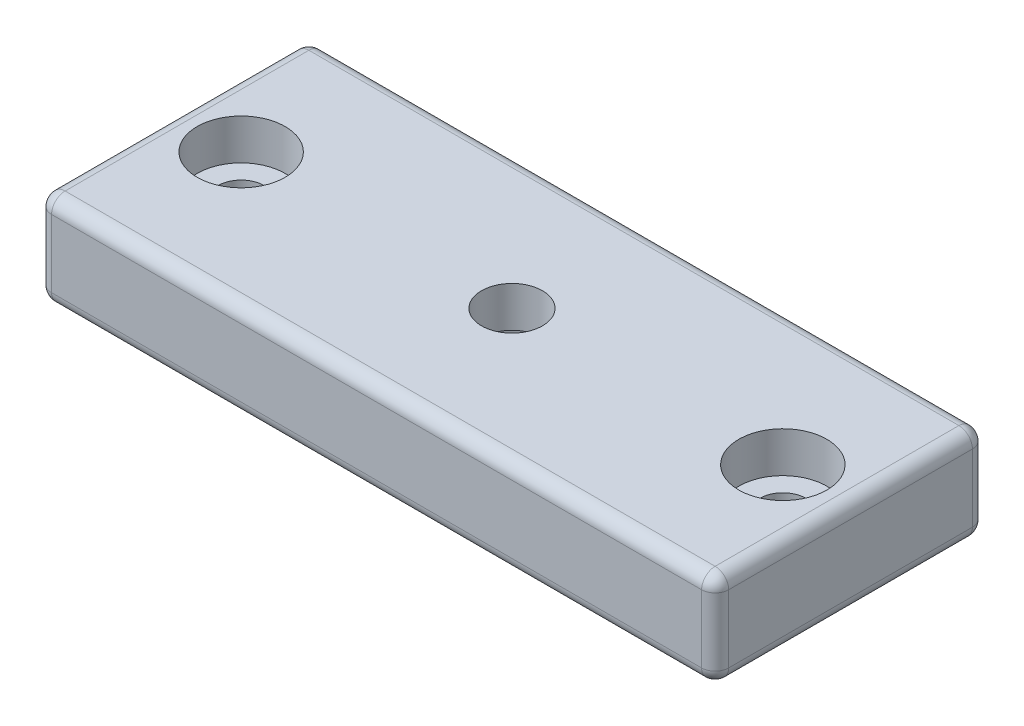
ISO-10303-21;
HEADER;
FILE_DESCRIPTION(('STEP AP214'),'2;1');
FILE_NAME('part.step','',(''),(''),'','','');
FILE_SCHEMA(('AUTOMOTIVE_DESIGN { 1 0 10303 214 1 1 1 1 }'));
ENDSEC;
DATA;
#1=APPLICATION_CONTEXT('core data for automotive mechanical design processes');
#2=APPLICATION_PROTOCOL_DEFINITION('international standard','automotive_design',2000,#1);
#3=PRODUCT_CONTEXT('',#1,'mechanical');
#4=PRODUCT('Part','Part','',(#3));
#5=PRODUCT_RELATED_PRODUCT_CATEGORY('part','',(#4));
#6=PRODUCT_DEFINITION_FORMATION('','',#4);
#7=PRODUCT_DEFINITION_CONTEXT('part definition',#1,'design');
#8=PRODUCT_DEFINITION('design','',#6,#7);
#9=PRODUCT_DEFINITION_SHAPE('','',#8);
#10=(LENGTH_UNIT() NAMED_UNIT(*) SI_UNIT(.MILLI.,.METRE.));
#11=(NAMED_UNIT(*) PLANE_ANGLE_UNIT() SI_UNIT($,.RADIAN.));
#12=(NAMED_UNIT(*) SI_UNIT($,.STERADIAN.) SOLID_ANGLE_UNIT());
#13=UNCERTAINTY_MEASURE_WITH_UNIT(LENGTH_MEASURE(1.E-05),#10,'distance_accuracy_value','');
#14=(GEOMETRIC_REPRESENTATION_CONTEXT(3) GLOBAL_UNCERTAINTY_ASSIGNED_CONTEXT((#13)) GLOBAL_UNIT_ASSIGNED_CONTEXT((#10,
#11,#12)) REPRESENTATION_CONTEXT('',''));
#15=CARTESIAN_POINT('',(0.,0.,0.));
#16=DIRECTION('',(0.,0.,1.));
#17=DIRECTION('',(1.,0.,0.));
#18=AXIS2_PLACEMENT_3D('',#15,#16,#17);
#19=CARTESIAN_POINT('',(-25.,7.,10.));
#20=DIRECTION('',(1.,0.,0.));
#21=DIRECTION('',(0.,0.,-1.));
#22=AXIS2_PLACEMENT_3D('',#19,#20,#21);
#23=PLANE('',#22);
#24=DIRECTION('',(0.,0.,1.));
#25=VECTOR('',#24,1.);
#26=CARTESIAN_POINT('',(-25.,1.,10.));
#27=LINE('',#26,#25);
#28=CARTESIAN_POINT('',(-25.,1.,-9.));
#29=VERTEX_POINT('',#28);
#30=CARTESIAN_POINT('',(-25.,1.,9.00000000000001));
#31=VERTEX_POINT('',#30);
#32=EDGE_CURVE('E187',#29,#31,#27,.T.);
#33=ORIENTED_EDGE('',*,*,#32,.T.);
#34=DIRECTION('',(0.,-1.,0.));
#35=VECTOR('',#34,1.);
#36=CARTESIAN_POINT('',(-25.,7.,9.00000000000001));
#37=LINE('',#36,#35);
#38=CARTESIAN_POINT('',(-25.,6.,9.00000000000001));
#39=VERTEX_POINT('',#38);
#40=EDGE_CURVE('E190',#31,#39,#37,.F.);
#41=ORIENTED_EDGE('',*,*,#40,.T.);
#42=DIRECTION('',(0.,0.,1.));
#43=VECTOR('',#42,1.);
#44=CARTESIAN_POINT('',(-25.,6.,-10.));
#45=LINE('',#44,#43);
#46=CARTESIAN_POINT('',(-25.,6.,-9.));
#47=VERTEX_POINT('',#46);
#48=EDGE_CURVE('E185',#39,#47,#45,.F.);
#49=ORIENTED_EDGE('',*,*,#48,.T.);
#50=DIRECTION('',(0.,-1.,0.));
#51=VECTOR('',#50,1.);
#52=CARTESIAN_POINT('',(-25.,7.,-9.));
#53=LINE('',#52,#51);
#54=EDGE_CURVE('E183',#47,#29,#53,.T.);
#55=ORIENTED_EDGE('',*,*,#54,.T.);
#56=EDGE_LOOP('',(#33,#41,#49,#55));
#57=FACE_BOUND('',#56,.T.);
#58=ADVANCED_FACE('F31',(#57),#23,.F.);
#59=CARTESIAN_POINT('',(25.,7.,10.));
#60=DIRECTION('',(0.,0.,-1.));
#61=DIRECTION('',(-1.,0.,0.));
#62=AXIS2_PLACEMENT_3D('',#59,#60,#61);
#63=PLANE('',#62);
#64=DIRECTION('',(1.,0.,0.));
#65=VECTOR('',#64,1.);
#66=CARTESIAN_POINT('',(-25.,6.,10.));
#67=LINE('',#66,#65);
#68=CARTESIAN_POINT('',(24.,6.,10.));
#69=VERTEX_POINT('',#68);
#70=CARTESIAN_POINT('',(-24.,6.,10.));
#71=VERTEX_POINT('',#70);
#72=EDGE_CURVE('E176',#69,#71,#67,.F.);
#73=ORIENTED_EDGE('',*,*,#72,.T.);
#74=DIRECTION('',(0.,-1.,0.));
#75=VECTOR('',#74,1.);
#76=CARTESIAN_POINT('',(-24.,7.,10.));
#77=LINE('',#76,#75);
#78=CARTESIAN_POINT('',(-24.,1.,10.));
#79=VERTEX_POINT('',#78);
#80=EDGE_CURVE('E181',#71,#79,#77,.T.);
#81=ORIENTED_EDGE('',*,*,#80,.T.);
#82=DIRECTION('',(1.,0.,0.));
#83=VECTOR('',#82,1.);
#84=CARTESIAN_POINT('',(25.,1.,10.));
#85=LINE('',#84,#83);
#86=CARTESIAN_POINT('',(24.,1.,10.));
#87=VERTEX_POINT('',#86);
#88=EDGE_CURVE('E178',#79,#87,#85,.T.);
#89=ORIENTED_EDGE('',*,*,#88,.T.);
#90=DIRECTION('',(0.,-1.,0.));
#91=VECTOR('',#90,1.);
#92=CARTESIAN_POINT('',(24.,7.,10.));
#93=LINE('',#92,#91);
#94=EDGE_CURVE('E174',#87,#69,#93,.F.);
#95=ORIENTED_EDGE('',*,*,#94,.T.);
#96=EDGE_LOOP('',(#73,#81,#89,#95));
#97=FACE_BOUND('',#96,.T.);
#98=ADVANCED_FACE('F334',(#97),#63,.F.);
#99=CARTESIAN_POINT('',(25.,7.,10.));
#100=DIRECTION('',(-1.,0.,0.));
#101=DIRECTION('',(0.,0.,1.));
#102=AXIS2_PLACEMENT_3D('',#99,#100,#101);
#103=PLANE('',#102);
#104=DIRECTION('',(0.,0.,-1.));
#105=VECTOR('',#104,1.);
#106=CARTESIAN_POINT('',(25.,6.,10.));
#107=LINE('',#106,#105);
#108=CARTESIAN_POINT('',(25.,6.,-9.00000000000001));
#109=VERTEX_POINT('',#108);
#110=CARTESIAN_POINT('',(25.,6.,9.));
#111=VERTEX_POINT('',#110);
#112=EDGE_CURVE('E128',#109,#111,#107,.F.);
#113=ORIENTED_EDGE('',*,*,#112,.T.);
#114=DIRECTION('',(0.,-1.,0.));
#115=VECTOR('',#114,1.);
#116=CARTESIAN_POINT('',(25.,7.,9.));
#117=LINE('',#116,#115);
#118=CARTESIAN_POINT('',(25.,1.,9.));
#119=VERTEX_POINT('',#118);
#120=EDGE_CURVE('E163',#111,#119,#117,.T.);
#121=ORIENTED_EDGE('',*,*,#120,.T.);
#122=DIRECTION('',(0.,0.,-1.));
#123=VECTOR('',#122,1.);
#124=CARTESIAN_POINT('',(25.,1.,10.));
#125=LINE('',#124,#123);
#126=CARTESIAN_POINT('',(25.,1.,-9.00000000000001));
#127=VERTEX_POINT('',#126);
#128=EDGE_CURVE('E156',#119,#127,#125,.T.);
#129=ORIENTED_EDGE('',*,*,#128,.T.);
#130=DIRECTION('',(0.,-1.,0.));
#131=VECTOR('',#130,1.);
#132=CARTESIAN_POINT('',(25.,7.,-9.00000000000001));
#133=LINE('',#132,#131);
#134=EDGE_CURVE('E154',#127,#109,#133,.F.);
#135=ORIENTED_EDGE('',*,*,#134,.T.);
#136=EDGE_LOOP('',(#113,#121,#129,#135));
#137=FACE_BOUND('',#136,.T.);
#138=ADVANCED_FACE('F308',(#137),#103,.F.);
#139=CARTESIAN_POINT('',(25.,7.,-10.));
#140=DIRECTION('',(0.,0.,1.));
#141=DIRECTION('',(1.,0.,0.));
#142=AXIS2_PLACEMENT_3D('',#139,#140,#141);
#143=PLANE('',#142);
#144=DIRECTION('',(-1.,0.,0.));
#145=VECTOR('',#144,1.);
#146=CARTESIAN_POINT('',(25.,6.,-10.));
#147=LINE('',#146,#145);
#148=CARTESIAN_POINT('',(-24.,6.,-10.));
#149=VERTEX_POINT('',#148);
#150=CARTESIAN_POINT('',(24.,6.,-10.));
#151=VERTEX_POINT('',#150);
#152=EDGE_CURVE('E40',#149,#151,#147,.F.);
#153=ORIENTED_EDGE('',*,*,#152,.T.);
#154=DIRECTION('',(0.,-1.,0.));
#155=VECTOR('',#154,1.);
#156=CARTESIAN_POINT('',(24.,7.,-10.));
#157=LINE('',#156,#155);
#158=CARTESIAN_POINT('',(24.,1.,-10.));
#159=VERTEX_POINT('',#158);
#160=EDGE_CURVE('E11',#151,#159,#157,.T.);
#161=ORIENTED_EDGE('',*,*,#160,.T.);
#162=DIRECTION('',(-1.,0.,0.));
#163=VECTOR('',#162,1.);
#164=CARTESIAN_POINT('',(25.,1.,-10.));
#165=LINE('',#164,#163);
#166=CARTESIAN_POINT('',(-24.,1.,-10.));
#167=VERTEX_POINT('',#166);
#168=EDGE_CURVE('E194',#159,#167,#165,.T.);
#169=ORIENTED_EDGE('',*,*,#168,.T.);
#170=DIRECTION('',(0.,-1.,0.));
#171=VECTOR('',#170,1.);
#172=CARTESIAN_POINT('',(-24.,7.,-10.));
#173=LINE('',#172,#171);
#174=EDGE_CURVE('E192',#167,#149,#173,.F.);
#175=ORIENTED_EDGE('',*,*,#174,.T.);
#176=EDGE_LOOP('',(#153,#161,#169,#175));
#177=FACE_BOUND('',#176,.T.);
#178=ADVANCED_FACE('F314',(#177),#143,.F.);
#179=CARTESIAN_POINT('',(-25.,7.,-10.));
#180=DIRECTION('',(0.,1.,0.));
#181=DIRECTION('',(0.,0.,1.));
#182=AXIS2_PLACEMENT_3D('',#179,#180,#181);
#183=PLANE('',#182);
#184=CARTESIAN_POINT('',(0.,7.,0.));
#185=DIRECTION('',(0.,-1.,0.));
#186=DIRECTION('',(0.,0.,-1.));
#187=AXIS2_PLACEMENT_3D('',#184,#185,#186);
#188=CIRCLE('',#187,2.25);
#189=CARTESIAN_POINT('',(0.,7.,-2.25));
#190=VERTEX_POINT('',#189);
#191=EDGE_CURVE('E130',#190,#190,#188,.T.);
#192=ORIENTED_EDGE('',*,*,#191,.T.);
#193=EDGE_LOOP('',(#192));
#194=FACE_BOUND('',#193,.T.);
#195=DIRECTION('',(1.,0.,0.));
#196=VECTOR('',#195,1.);
#197=CARTESIAN_POINT('',(25.,7.,9.));
#198=LINE('',#197,#196);
#199=CARTESIAN_POINT('',(-24.,7.,9.00000000000001));
#200=VERTEX_POINT('',#199);
#201=CARTESIAN_POINT('',(24.,7.,9.));
#202=VERTEX_POINT('',#201);
#203=EDGE_CURVE('E152',#200,#202,#198,.T.);
#204=ORIENTED_EDGE('',*,*,#203,.T.);
#205=DIRECTION('',(0.,0.,-1.));
#206=VECTOR('',#205,1.);
#207=CARTESIAN_POINT('',(24.,7.,-10.));
#208=LINE('',#207,#206);
#209=CARTESIAN_POINT('',(24.,7.,-9.00000000000001));
#210=VERTEX_POINT('',#209);
#211=EDGE_CURVE('E126',#202,#210,#208,.T.);
#212=ORIENTED_EDGE('',*,*,#211,.T.);
#213=DIRECTION('',(-1.,0.,0.));
#214=VECTOR('',#213,1.);
#215=CARTESIAN_POINT('',(-25.,7.,-9.));
#216=LINE('',#215,#214);
#217=CARTESIAN_POINT('',(-24.,7.,-9.));
#218=VERTEX_POINT('',#217);
#219=EDGE_CURVE('E140',#210,#218,#216,.T.);
#220=ORIENTED_EDGE('',*,*,#219,.T.);
#221=DIRECTION('',(0.,0.,1.));
#222=VECTOR('',#221,1.);
#223=CARTESIAN_POINT('',(-24.,7.,10.));
#224=LINE('',#223,#222);
#225=EDGE_CURVE('E146',#218,#200,#224,.T.);
#226=ORIENTED_EDGE('',*,*,#225,.T.);
#227=EDGE_LOOP('',(#204,#212,#220,#226));
#228=FACE_BOUND('',#227,.T.);
#229=CARTESIAN_POINT('',(-20.,7.,0.));
#230=DIRECTION('',(0.,1.,0.));
#231=DIRECTION('',(0.,0.,1.));
#232=AXIS2_PLACEMENT_3D('',#229,#230,#231);
#233=CIRCLE('',#232,3.25);
#234=CARTESIAN_POINT('',(-20.,7.,3.25));
#235=VERTEX_POINT('',#234);
#236=EDGE_CURVE('E255',#235,#235,#233,.T.);
#237=ORIENTED_EDGE('',*,*,#236,.F.);
#238=EDGE_LOOP('',(#237));
#239=FACE_BOUND('',#238,.T.);
#240=CARTESIAN_POINT('',(20.,7.,0.));
#241=DIRECTION('',(0.,1.,0.));
#242=DIRECTION('',(0.,0.,1.));
#243=AXIS2_PLACEMENT_3D('',#240,#241,#242);
#244=CIRCLE('',#243,3.25);
#245=CARTESIAN_POINT('',(20.,7.,3.25));
#246=VERTEX_POINT('',#245);
#247=EDGE_CURVE('E276',#246,#246,#244,.T.);
#248=ORIENTED_EDGE('',*,*,#247,.F.);
#249=EDGE_LOOP('',(#248));
#250=FACE_BOUND('',#249,.T.);
#251=ADVANCED_FACE('F149',(#194,#228,#239,#250),#183,.T.);
#252=CARTESIAN_POINT('',(-25.,0.,-10.));
#253=DIRECTION('',(0.,1.,0.));
#254=DIRECTION('',(0.,0.,1.));
#255=AXIS2_PLACEMENT_3D('',#252,#253,#254);
#256=PLANE('',#255);
#257=CARTESIAN_POINT('',(0.,0.,0.));
#258=DIRECTION('',(0.,-1.,0.));
#259=DIRECTION('',(0.,0.,-1.));
#260=AXIS2_PLACEMENT_3D('',#257,#258,#259);
#261=CIRCLE('',#260,3.99999999999999);
#262=CARTESIAN_POINT('',(0.,0.,-3.99999999999999));
#263=VERTEX_POINT('',#262);
#264=EDGE_CURVE('E647',#263,#263,#261,.T.);
#265=ORIENTED_EDGE('',*,*,#264,.F.);
#266=EDGE_LOOP('',(#265));
#267=FACE_BOUND('',#266,.T.);
#268=DIRECTION('',(-1.,0.,0.));
#269=VECTOR('',#268,1.);
#270=CARTESIAN_POINT('',(-25.,0.,-9.));
#271=LINE('',#270,#269);
#272=CARTESIAN_POINT('',(-24.,0.,-9.));
#273=VERTEX_POINT('',#272);
#274=CARTESIAN_POINT('',(24.,0.,-9.00000000000001));
#275=VERTEX_POINT('',#274);
#276=EDGE_CURVE('E165',#273,#275,#271,.F.);
#277=ORIENTED_EDGE('',*,*,#276,.T.);
#278=DIRECTION('',(0.,0.,-1.));
#279=VECTOR('',#278,1.);
#280=CARTESIAN_POINT('',(24.,0.,-10.));
#281=LINE('',#280,#279);
#282=CARTESIAN_POINT('',(24.,0.,9.));
#283=VERTEX_POINT('',#282);
#284=EDGE_CURVE('E171',#275,#283,#281,.F.);
#285=ORIENTED_EDGE('',*,*,#284,.T.);
#286=DIRECTION('',(1.,0.,0.));
#287=VECTOR('',#286,1.);
#288=CARTESIAN_POINT('',(-25.,0.,9.00000000000001));
#289=LINE('',#288,#287);
#290=CARTESIAN_POINT('',(-24.,0.,9.00000000000001));
#291=VERTEX_POINT('',#290);
#292=EDGE_CURVE('E169',#283,#291,#289,.F.);
#293=ORIENTED_EDGE('',*,*,#292,.T.);
#294=DIRECTION('',(0.,0.,1.));
#295=VECTOR('',#294,1.);
#296=CARTESIAN_POINT('',(-24.,0.,-10.));
#297=LINE('',#296,#295);
#298=EDGE_CURVE('E167',#291,#273,#297,.F.);
#299=ORIENTED_EDGE('',*,*,#298,.T.);
#300=EDGE_LOOP('',(#277,#285,#293,#299));
#301=FACE_BOUND('',#300,.T.);
#302=CARTESIAN_POINT('',(-20.,0.,0.));
#303=DIRECTION('',(0.,1.,0.));
#304=DIRECTION('',(0.,0.,1.));
#305=AXIS2_PLACEMENT_3D('',#302,#303,#304);
#306=CIRCLE('',#305,1.7);
#307=CARTESIAN_POINT('',(-20.,0.,1.7));
#308=VERTEX_POINT('',#307);
#309=EDGE_CURVE('E273',#308,#308,#306,.T.);
#310=ORIENTED_EDGE('',*,*,#309,.T.);
#311=EDGE_LOOP('',(#310));
#312=FACE_BOUND('',#311,.T.);
#313=CARTESIAN_POINT('',(20.,0.,0.));
#314=DIRECTION('',(0.,1.,0.));
#315=DIRECTION('',(0.,0.,1.));
#316=AXIS2_PLACEMENT_3D('',#313,#314,#315);
#317=CIRCLE('',#316,1.7);
#318=CARTESIAN_POINT('',(20.,0.,1.7));
#319=VERTEX_POINT('',#318);
#320=EDGE_CURVE('E147',#319,#319,#317,.T.);
#321=ORIENTED_EDGE('',*,*,#320,.T.);
#322=EDGE_LOOP('',(#321));
#323=FACE_BOUND('',#322,.T.);
#324=ADVANCED_FACE('F579',(#267,#301,#312,#323),#256,.F.);
#325=CARTESIAN_POINT('',(20.,7.,0.));
#326=DIRECTION('',(0.,1.,0.));
#327=DIRECTION('',(0.,0.,1.));
#328=AXIS2_PLACEMENT_3D('',#325,#326,#327);
#329=CYLINDRICAL_SURFACE('',#328,1.7);
#330=ORIENTED_EDGE('',*,*,#320,.F.);
#331=EDGE_LOOP('',(#330));
#332=FACE_BOUND('',#331,.T.);
#333=CARTESIAN_POINT('',(20.,4.,0.));
#334=DIRECTION('',(0.,1.,0.));
#335=DIRECTION('',(0.,0.,1.));
#336=AXIS2_PLACEMENT_3D('',#333,#334,#335);
#337=CIRCLE('',#336,1.7);
#338=CARTESIAN_POINT('',(20.,4.,1.7));
#339=VERTEX_POINT('',#338);
#340=EDGE_CURVE('E282',#339,#339,#337,.T.);
#341=ORIENTED_EDGE('',*,*,#340,.T.);
#342=EDGE_LOOP('',(#341));
#343=FACE_BOUND('',#342,.T.);
#344=ADVANCED_FACE('F570',(#332,#343),#329,.F.);
#345=CARTESIAN_POINT('',(21.7,4.,0.));
#346=DIRECTION('',(0.,-1.,0.));
#347=DIRECTION('',(0.,0.,-1.));
#348=AXIS2_PLACEMENT_3D('',#345,#346,#347);
#349=PLANE('',#348);
#350=ORIENTED_EDGE('',*,*,#340,.F.);
#351=EDGE_LOOP('',(#350));
#352=FACE_BOUND('',#351,.T.);
#353=CARTESIAN_POINT('',(20.,4.,0.));
#354=DIRECTION('',(0.,1.,0.));
#355=DIRECTION('',(0.,0.,1.));
#356=AXIS2_PLACEMENT_3D('',#353,#354,#355);
#357=CIRCLE('',#356,3.25);
#358=CARTESIAN_POINT('',(20.,4.,3.25));
#359=VERTEX_POINT('',#358);
#360=EDGE_CURVE('E279',#359,#359,#357,.T.);
#361=ORIENTED_EDGE('',*,*,#360,.T.);
#362=EDGE_LOOP('',(#361));
#363=FACE_BOUND('',#362,.T.);
#364=ADVANCED_FACE('F561',(#352,#363),#349,.F.);
#365=CARTESIAN_POINT('',(20.,7.,0.));
#366=DIRECTION('',(0.,1.,0.));
#367=DIRECTION('',(0.,0.,1.));
#368=AXIS2_PLACEMENT_3D('',#365,#366,#367);
#369=CYLINDRICAL_SURFACE('',#368,3.25);
#370=ORIENTED_EDGE('',*,*,#360,.F.);
#371=EDGE_LOOP('',(#370));
#372=FACE_BOUND('',#371,.T.);
#373=ORIENTED_EDGE('',*,*,#247,.T.);
#374=EDGE_LOOP('',(#373));
#375=FACE_BOUND('',#374,.T.);
#376=ADVANCED_FACE('F552',(#372,#375),#369,.F.);
#377=CARTESIAN_POINT('',(-20.,7.,0.));
#378=DIRECTION('',(0.,1.,0.));
#379=DIRECTION('',(0.,0.,1.));
#380=AXIS2_PLACEMENT_3D('',#377,#378,#379);
#381=CYLINDRICAL_SURFACE('',#380,1.7);
#382=ORIENTED_EDGE('',*,*,#309,.F.);
#383=EDGE_LOOP('',(#382));
#384=FACE_BOUND('',#383,.T.);
#385=CARTESIAN_POINT('',(-20.,4.,0.));
#386=DIRECTION('',(0.,1.,0.));
#387=DIRECTION('',(0.,0.,1.));
#388=AXIS2_PLACEMENT_3D('',#385,#386,#387);
#389=CIRCLE('',#388,1.7);
#390=CARTESIAN_POINT('',(-20.,4.,1.7));
#391=VERTEX_POINT('',#390);
#392=EDGE_CURVE('E266',#391,#391,#389,.T.);
#393=ORIENTED_EDGE('',*,*,#392,.T.);
#394=EDGE_LOOP('',(#393));
#395=FACE_BOUND('',#394,.T.);
#396=ADVANCED_FACE('F543',(#384,#395),#381,.F.);
#397=CARTESIAN_POINT('',(-18.3,4.,0.));
#398=DIRECTION('',(0.,-1.,0.));
#399=DIRECTION('',(0.,0.,-1.));
#400=AXIS2_PLACEMENT_3D('',#397,#398,#399);
#401=PLANE('',#400);
#402=ORIENTED_EDGE('',*,*,#392,.F.);
#403=EDGE_LOOP('',(#402));
#404=FACE_BOUND('',#403,.T.);
#405=CARTESIAN_POINT('',(-20.,4.,0.));
#406=DIRECTION('',(0.,1.,0.));
#407=DIRECTION('',(0.,0.,1.));
#408=AXIS2_PLACEMENT_3D('',#405,#406,#407);
#409=CIRCLE('',#408,3.25);
#410=CARTESIAN_POINT('',(-20.,4.,3.25));
#411=VERTEX_POINT('',#410);
#412=EDGE_CURVE('E261',#411,#411,#409,.T.);
#413=ORIENTED_EDGE('',*,*,#412,.T.);
#414=EDGE_LOOP('',(#413));
#415=FACE_BOUND('',#414,.T.);
#416=ADVANCED_FACE('F534',(#404,#415),#401,.F.);
#417=CARTESIAN_POINT('',(-20.,7.,0.));
#418=DIRECTION('',(0.,1.,0.));
#419=DIRECTION('',(0.,0.,1.));
#420=AXIS2_PLACEMENT_3D('',#417,#418,#419);
#421=CYLINDRICAL_SURFACE('',#420,3.25);
#422=ORIENTED_EDGE('',*,*,#412,.F.);
#423=EDGE_LOOP('',(#422));
#424=FACE_BOUND('',#423,.T.);
#425=ORIENTED_EDGE('',*,*,#236,.T.);
#426=EDGE_LOOP('',(#425));
#427=FACE_BOUND('',#426,.T.);
#428=ADVANCED_FACE('F525',(#424,#427),#421,.F.);
#429=CARTESIAN_POINT('',(-24.,1.,10.));
#430=DIRECTION('',(0.,0.,1.));
#431=DIRECTION('',(1.,0.,0.));
#432=AXIS2_PLACEMENT_3D('',#429,#430,#431);
#433=CYLINDRICAL_SURFACE('',#432,1.);
#434=CARTESIAN_POINT('',(-24.,1.,9.00000000000001));
#435=DIRECTION('',(0.,0.,1.));
#436=DIRECTION('',(1.,0.,0.));
#437=AXIS2_PLACEMENT_3D('',#434,#435,#436);
#438=CIRCLE('',#437,1.);
#439=EDGE_CURVE('E35',#31,#291,#438,.T.);
#440=ORIENTED_EDGE('',*,*,#439,.F.);
#441=ORIENTED_EDGE('',*,*,#32,.F.);
#442=CARTESIAN_POINT('',(-24.,1.,-9.));
#443=DIRECTION('',(0.,0.,-1.));
#444=DIRECTION('',(-1.,0.,0.));
#445=AXIS2_PLACEMENT_3D('',#442,#443,#444);
#446=CIRCLE('',#445,1.);
#447=EDGE_CURVE('E248',#273,#29,#446,.T.);
#448=ORIENTED_EDGE('',*,*,#447,.F.);
#449=ORIENTED_EDGE('',*,*,#298,.F.);
#450=EDGE_LOOP('',(#440,#441,#448,#449));
#451=FACE_BOUND('',#450,.T.);
#452=ADVANCED_FACE('F33',(#451),#433,.T.);
#453=CARTESIAN_POINT('',(-24.,1.,9.00000000000001));
#454=DIRECTION('',(0.,0.,1.));
#455=DIRECTION('',(1.,0.,0.));
#456=AXIS2_PLACEMENT_3D('',#453,#454,#455);
#457=SPHERICAL_SURFACE('',#456,1.);
#458=CARTESIAN_POINT('',(-24.,1.,9.00000000000001));
#459=DIRECTION('',(0.,-1.,0.));
#460=DIRECTION('',(0.,0.,-1.));
#461=AXIS2_PLACEMENT_3D('',#458,#459,#460);
#462=CIRCLE('',#461,1.);
#463=EDGE_CURVE('E243',#31,#79,#462,.F.);
#464=ORIENTED_EDGE('',*,*,#463,.F.);
#465=ORIENTED_EDGE('',*,*,#439,.T.);
#466=CARTESIAN_POINT('',(-24.,1.,9.00000000000001));
#467=DIRECTION('',(-1.,0.,0.));
#468=DIRECTION('',(0.,0.,1.));
#469=AXIS2_PLACEMENT_3D('',#466,#467,#468);
#470=CIRCLE('',#469,1.);
#471=EDGE_CURVE('E246',#79,#291,#470,.F.);
#472=ORIENTED_EDGE('',*,*,#471,.F.);
#473=EDGE_LOOP('',(#464,#465,#472));
#474=FACE_BOUND('',#473,.T.);
#475=ADVANCED_FACE('F511',(#474),#457,.T.);
#476=CARTESIAN_POINT('',(-24.,1.,-9.));
#477=DIRECTION('',(0.,0.,1.));
#478=DIRECTION('',(1.,0.,0.));
#479=AXIS2_PLACEMENT_3D('',#476,#477,#478);
#480=SPHERICAL_SURFACE('',#479,1.);
#481=CARTESIAN_POINT('',(-24.,1.,-9.));
#482=DIRECTION('',(-1.,0.,0.));
#483=DIRECTION('',(0.,0.,1.));
#484=AXIS2_PLACEMENT_3D('',#481,#482,#483);
#485=CIRCLE('',#484,1.);
#486=EDGE_CURVE('E237',#273,#167,#485,.F.);
#487=ORIENTED_EDGE('',*,*,#486,.F.);
#488=ORIENTED_EDGE('',*,*,#447,.T.);
#489=CARTESIAN_POINT('',(-24.,1.,-9.));
#490=DIRECTION('',(0.,-1.,0.));
#491=DIRECTION('',(0.,0.,-1.));
#492=AXIS2_PLACEMENT_3D('',#489,#490,#491);
#493=CIRCLE('',#492,1.);
#494=EDGE_CURVE('E240',#167,#29,#493,.F.);
#495=ORIENTED_EDGE('',*,*,#494,.F.);
#496=EDGE_LOOP('',(#487,#488,#495));
#497=FACE_BOUND('',#496,.T.);
#498=ADVANCED_FACE('F502',(#497),#480,.T.);
#499=CARTESIAN_POINT('',(25.,1.,9.));
#500=DIRECTION('',(1.,0.,0.));
#501=DIRECTION('',(0.,0.,-1.));
#502=AXIS2_PLACEMENT_3D('',#499,#500,#501);
#503=CYLINDRICAL_SURFACE('',#502,1.);
#504=ORIENTED_EDGE('',*,*,#471,.T.);
#505=ORIENTED_EDGE('',*,*,#292,.F.);
#506=CARTESIAN_POINT('',(24.,1.,9.));
#507=DIRECTION('',(1.,0.,0.));
#508=DIRECTION('',(0.,0.,-1.));
#509=AXIS2_PLACEMENT_3D('',#506,#507,#508);
#510=CIRCLE('',#509,1.);
#511=EDGE_CURVE('E232',#87,#283,#510,.T.);
#512=ORIENTED_EDGE('',*,*,#511,.F.);
#513=ORIENTED_EDGE('',*,*,#88,.F.);
#514=EDGE_LOOP('',(#504,#505,#512,#513));
#515=FACE_BOUND('',#514,.T.);
#516=ADVANCED_FACE('F493',(#515),#503,.T.);
#517=CARTESIAN_POINT('',(-24.,7.,9.00000000000001));
#518=DIRECTION('',(0.,-1.,0.));
#519=DIRECTION('',(0.,0.,-1.));
#520=AXIS2_PLACEMENT_3D('',#517,#518,#519);
#521=CYLINDRICAL_SURFACE('',#520,1.);
#522=ORIENTED_EDGE('',*,*,#463,.T.);
#523=ORIENTED_EDGE('',*,*,#80,.F.);
#524=CARTESIAN_POINT('',(-24.,6.,9.00000000000001));
#525=DIRECTION('',(0.,1.,0.));
#526=DIRECTION('',(0.,0.,1.));
#527=AXIS2_PLACEMENT_3D('',#524,#525,#526);
#528=CIRCLE('',#527,1.);
#529=EDGE_CURVE('E229',#39,#71,#528,.T.);
#530=ORIENTED_EDGE('',*,*,#529,.F.);
#531=ORIENTED_EDGE('',*,*,#40,.F.);
#532=EDGE_LOOP('',(#522,#523,#530,#531));
#533=FACE_BOUND('',#532,.T.);
#534=ADVANCED_FACE('F485',(#533),#521,.T.);
#535=CARTESIAN_POINT('',(-24.,6.,-10.));
#536=DIRECTION('',(0.,0.,-1.));
#537=DIRECTION('',(-1.,0.,0.));
#538=AXIS2_PLACEMENT_3D('',#535,#536,#537);
#539=CYLINDRICAL_SURFACE('',#538,1.);
#540=CARTESIAN_POINT('',(-24.,6.,-9.));
#541=DIRECTION('',(0.,0.,-1.));
#542=DIRECTION('',(0.,1.,0.));
#543=AXIS2_PLACEMENT_3D('',#540,#541,#542);
#544=CIRCLE('',#543,1.);
#545=EDGE_CURVE('E223',#47,#218,#544,.T.);
#546=ORIENTED_EDGE('',*,*,#545,.F.);
#547=ORIENTED_EDGE('',*,*,#48,.F.);
#548=CARTESIAN_POINT('',(-24.,6.,9.00000000000001));
#549=DIRECTION('',(0.,0.,1.));
#550=DIRECTION('',(1.,0.,0.));
#551=AXIS2_PLACEMENT_3D('',#548,#549,#550);
#552=CIRCLE('',#551,1.);
#553=EDGE_CURVE('E226',#200,#39,#552,.T.);
#554=ORIENTED_EDGE('',*,*,#553,.F.);
#555=ORIENTED_EDGE('',*,*,#225,.F.);
#556=EDGE_LOOP('',(#546,#547,#554,#555));
#557=FACE_BOUND('',#556,.T.);
#558=ADVANCED_FACE('F291',(#557),#539,.T.);
#559=CARTESIAN_POINT('',(-24.,7.,-9.));
#560=DIRECTION('',(0.,-1.,0.));
#561=DIRECTION('',(0.,0.,-1.));
#562=AXIS2_PLACEMENT_3D('',#559,#560,#561);
#563=CYLINDRICAL_SURFACE('',#562,1.);
#564=ORIENTED_EDGE('',*,*,#494,.T.);
#565=ORIENTED_EDGE('',*,*,#54,.F.);
#566=CARTESIAN_POINT('',(-24.,6.,-9.));
#567=DIRECTION('',(0.,1.,0.));
#568=DIRECTION('',(0.,0.,1.));
#569=AXIS2_PLACEMENT_3D('',#566,#567,#568);
#570=CIRCLE('',#569,1.);
#571=EDGE_CURVE('E220',#149,#47,#570,.T.);
#572=ORIENTED_EDGE('',*,*,#571,.F.);
#573=ORIENTED_EDGE('',*,*,#174,.F.);
#574=EDGE_LOOP('',(#564,#565,#572,#573));
#575=FACE_BOUND('',#574,.T.);
#576=ADVANCED_FACE('F319',(#575),#563,.T.);
#577=CARTESIAN_POINT('',(25.,1.,-9.00000000000001));
#578=DIRECTION('',(-1.,0.,0.));
#579=DIRECTION('',(0.,0.,1.));
#580=AXIS2_PLACEMENT_3D('',#577,#578,#579);
#581=CYLINDRICAL_SURFACE('',#580,1.);
#582=ORIENTED_EDGE('',*,*,#486,.T.);
#583=ORIENTED_EDGE('',*,*,#168,.F.);
#584=CARTESIAN_POINT('',(24.,1.,-9.00000000000001));
#585=DIRECTION('',(1.,0.,0.));
#586=DIRECTION('',(0.,0.,-1.));
#587=AXIS2_PLACEMENT_3D('',#584,#585,#586);
#588=CIRCLE('',#587,1.);
#589=EDGE_CURVE('E217',#275,#159,#588,.T.);
#590=ORIENTED_EDGE('',*,*,#589,.F.);
#591=ORIENTED_EDGE('',*,*,#276,.F.);
#592=EDGE_LOOP('',(#582,#583,#590,#591));
#593=FACE_BOUND('',#592,.T.);
#594=ADVANCED_FACE('F461',(#593),#581,.T.);
#595=CARTESIAN_POINT('',(24.,1.,10.));
#596=DIRECTION('',(0.,0.,-1.));
#597=DIRECTION('',(-1.,0.,0.));
#598=AXIS2_PLACEMENT_3D('',#595,#596,#597);
#599=CYLINDRICAL_SURFACE('',#598,1.);
#600=CARTESIAN_POINT('',(24.,1.,9.));
#601=DIRECTION('',(0.,0.,1.));
#602=DIRECTION('',(1.,0.,0.));
#603=AXIS2_PLACEMENT_3D('',#600,#601,#602);
#604=CIRCLE('',#603,1.);
#605=EDGE_CURVE('E234',#283,#119,#604,.T.);
#606=ORIENTED_EDGE('',*,*,#605,.F.);
#607=ORIENTED_EDGE('',*,*,#284,.F.);
#608=CARTESIAN_POINT('',(24.,1.,-9.00000000000001));
#609=DIRECTION('',(0.,0.,-1.));
#610=DIRECTION('',(-1.,0.,0.));
#611=AXIS2_PLACEMENT_3D('',#608,#609,#610);
#612=CIRCLE('',#611,1.);
#613=EDGE_CURVE('E214',#127,#275,#612,.T.);
#614=ORIENTED_EDGE('',*,*,#613,.F.);
#615=ORIENTED_EDGE('',*,*,#128,.F.);
#616=EDGE_LOOP('',(#606,#607,#614,#615));
#617=FACE_BOUND('',#616,.T.);
#618=ADVANCED_FACE('F452',(#617),#599,.T.);
#619=CARTESIAN_POINT('',(24.,1.,9.));
#620=DIRECTION('',(0.,0.,1.));
#621=DIRECTION('',(1.,0.,0.));
#622=AXIS2_PLACEMENT_3D('',#619,#620,#621);
#623=SPHERICAL_SURFACE('',#622,1.);
#624=ORIENTED_EDGE('',*,*,#511,.T.);
#625=ORIENTED_EDGE('',*,*,#605,.T.);
#626=CARTESIAN_POINT('',(24.,1.,9.));
#627=DIRECTION('',(0.,-1.,0.));
#628=DIRECTION('',(0.,0.,-1.));
#629=AXIS2_PLACEMENT_3D('',#626,#627,#628);
#630=CIRCLE('',#629,1.);
#631=EDGE_CURVE('E211',#87,#119,#630,.F.);
#632=ORIENTED_EDGE('',*,*,#631,.F.);
#633=EDGE_LOOP('',(#624,#625,#632));
#634=FACE_BOUND('',#633,.T.);
#635=ADVANCED_FACE('F331',(#634),#623,.T.);
#636=CARTESIAN_POINT('',(-24.,6.,9.00000000000001));
#637=DIRECTION('',(0.,0.,1.));
#638=DIRECTION('',(1.,0.,0.));
#639=AXIS2_PLACEMENT_3D('',#636,#637,#638);
#640=SPHERICAL_SURFACE('',#639,1.);
#641=ORIENTED_EDGE('',*,*,#553,.T.);
#642=ORIENTED_EDGE('',*,*,#529,.T.);
#643=CARTESIAN_POINT('',(-24.,6.,9.00000000000001));
#644=DIRECTION('',(-1.,0.,0.));
#645=DIRECTION('',(0.,0.,1.));
#646=AXIS2_PLACEMENT_3D('',#643,#644,#645);
#647=CIRCLE('',#646,1.);
#648=EDGE_CURVE('E208',#200,#71,#647,.F.);
#649=ORIENTED_EDGE('',*,*,#648,.F.);
#650=EDGE_LOOP('',(#641,#642,#649));
#651=FACE_BOUND('',#650,.T.);
#652=ADVANCED_FACE('F294',(#651),#640,.T.);
#653=CARTESIAN_POINT('',(-24.,6.,-9.));
#654=DIRECTION('',(0.,0.,1.));
#655=DIRECTION('',(1.,0.,0.));
#656=AXIS2_PLACEMENT_3D('',#653,#654,#655);
#657=SPHERICAL_SURFACE('',#656,1.);
#658=ORIENTED_EDGE('',*,*,#571,.T.);
#659=ORIENTED_EDGE('',*,*,#545,.T.);
#660=CARTESIAN_POINT('',(-24.,6.,-9.));
#661=DIRECTION('',(-1.,0.,0.));
#662=DIRECTION('',(0.,0.,1.));
#663=AXIS2_PLACEMENT_3D('',#660,#661,#662);
#664=CIRCLE('',#663,1.);
#665=EDGE_CURVE('E143',#149,#218,#664,.F.);
#666=ORIENTED_EDGE('',*,*,#665,.F.);
#667=EDGE_LOOP('',(#658,#659,#666));
#668=FACE_BOUND('',#667,.T.);
#669=ADVANCED_FACE('F321',(#668),#657,.T.);
#670=CARTESIAN_POINT('',(24.,1.,-9.00000000000001));
#671=DIRECTION('',(0.,0.,1.));
#672=DIRECTION('',(1.,0.,0.));
#673=AXIS2_PLACEMENT_3D('',#670,#671,#672);
#674=SPHERICAL_SURFACE('',#673,1.);
#675=ORIENTED_EDGE('',*,*,#613,.T.);
#676=ORIENTED_EDGE('',*,*,#589,.T.);
#677=CARTESIAN_POINT('',(24.,1.,-9.00000000000001));
#678=DIRECTION('',(0.,-1.,0.));
#679=DIRECTION('',(0.,0.,-1.));
#680=AXIS2_PLACEMENT_3D('',#677,#678,#679);
#681=CIRCLE('',#680,1.);
#682=EDGE_CURVE('E204',#127,#159,#681,.F.);
#683=ORIENTED_EDGE('',*,*,#682,.F.);
#684=EDGE_LOOP('',(#675,#676,#683));
#685=FACE_BOUND('',#684,.T.);
#686=ADVANCED_FACE('F323',(#685),#674,.T.);
#687=CARTESIAN_POINT('',(24.,7.,9.));
#688=DIRECTION('',(0.,-1.,0.));
#689=DIRECTION('',(0.,0.,-1.));
#690=AXIS2_PLACEMENT_3D('',#687,#688,#689);
#691=CYLINDRICAL_SURFACE('',#690,1.);
#692=ORIENTED_EDGE('',*,*,#631,.T.);
#693=ORIENTED_EDGE('',*,*,#120,.F.);
#694=CARTESIAN_POINT('',(24.,6.,9.));
#695=DIRECTION('',(0.,1.,0.));
#696=DIRECTION('',(0.,0.,1.));
#697=AXIS2_PLACEMENT_3D('',#694,#695,#696);
#698=CIRCLE('',#697,1.);
#699=EDGE_CURVE('E201',#69,#111,#698,.T.);
#700=ORIENTED_EDGE('',*,*,#699,.F.);
#701=ORIENTED_EDGE('',*,*,#94,.F.);
#702=EDGE_LOOP('',(#692,#693,#700,#701));
#703=FACE_BOUND('',#702,.T.);
#704=ADVANCED_FACE('F304',(#703),#691,.T.);
#705=CARTESIAN_POINT('',(-25.,6.,9.00000000000001));
#706=DIRECTION('',(-1.,0.,0.));
#707=DIRECTION('',(0.,0.,1.));
#708=AXIS2_PLACEMENT_3D('',#705,#706,#707);
#709=CYLINDRICAL_SURFACE('',#708,1.);
#710=ORIENTED_EDGE('',*,*,#648,.T.);
#711=ORIENTED_EDGE('',*,*,#72,.F.);
#712=CARTESIAN_POINT('',(24.,6.,9.));
#713=DIRECTION('',(1.,0.,0.));
#714=DIRECTION('',(0.,0.,-1.));
#715=AXIS2_PLACEMENT_3D('',#712,#713,#714);
#716=CIRCLE('',#715,1.);
#717=EDGE_CURVE('E137',#202,#69,#716,.T.);
#718=ORIENTED_EDGE('',*,*,#717,.F.);
#719=ORIENTED_EDGE('',*,*,#203,.F.);
#720=EDGE_LOOP('',(#710,#711,#718,#719));
#721=FACE_BOUND('',#720,.T.);
#722=ADVANCED_FACE('F297',(#721),#709,.T.);
#723=CARTESIAN_POINT('',(-25.,6.,-9.));
#724=DIRECTION('',(1.,0.,0.));
#725=DIRECTION('',(0.,0.,-1.));
#726=AXIS2_PLACEMENT_3D('',#723,#724,#725);
#727=CYLINDRICAL_SURFACE('',#726,1.);
#728=ORIENTED_EDGE('',*,*,#665,.T.);
#729=ORIENTED_EDGE('',*,*,#219,.F.);
#730=CARTESIAN_POINT('',(24.,6.,-9.00000000000001));
#731=DIRECTION('',(1.,0.,0.));
#732=DIRECTION('',(0.,0.,-1.));
#733=AXIS2_PLACEMENT_3D('',#730,#731,#732);
#734=CIRCLE('',#733,1.);
#735=EDGE_CURVE('E132',#151,#210,#734,.T.);
#736=ORIENTED_EDGE('',*,*,#735,.F.);
#737=ORIENTED_EDGE('',*,*,#152,.F.);
#738=EDGE_LOOP('',(#728,#729,#736,#737));
#739=FACE_BOUND('',#738,.T.);
#740=ADVANCED_FACE('F141',(#739),#727,.T.);
#741=CARTESIAN_POINT('',(24.,7.,-9.00000000000001));
#742=DIRECTION('',(0.,-1.,0.));
#743=DIRECTION('',(0.,0.,-1.));
#744=AXIS2_PLACEMENT_3D('',#741,#742,#743);
#745=CYLINDRICAL_SURFACE('',#744,1.);
#746=ORIENTED_EDGE('',*,*,#682,.T.);
#747=ORIENTED_EDGE('',*,*,#160,.F.);
#748=CARTESIAN_POINT('',(24.,6.,-9.00000000000001));
#749=DIRECTION('',(0.,1.,0.));
#750=DIRECTION('',(0.,0.,1.));
#751=AXIS2_PLACEMENT_3D('',#748,#749,#750);
#752=CIRCLE('',#751,1.);
#753=EDGE_CURVE('E48',#109,#151,#752,.T.);
#754=ORIENTED_EDGE('',*,*,#753,.F.);
#755=ORIENTED_EDGE('',*,*,#134,.F.);
#756=EDGE_LOOP('',(#746,#747,#754,#755));
#757=FACE_BOUND('',#756,.T.);
#758=ADVANCED_FACE('F312',(#757),#745,.T.);
#759=CARTESIAN_POINT('',(24.,6.,9.));
#760=DIRECTION('',(0.,0.,1.));
#761=DIRECTION('',(1.,0.,0.));
#762=AXIS2_PLACEMENT_3D('',#759,#760,#761);
#763=SPHERICAL_SURFACE('',#762,1.);
#764=ORIENTED_EDGE('',*,*,#717,.T.);
#765=ORIENTED_EDGE('',*,*,#699,.T.);
#766=CARTESIAN_POINT('',(24.,6.,9.));
#767=DIRECTION('',(0.,0.,1.));
#768=DIRECTION('',(1.,0.,0.));
#769=AXIS2_PLACEMENT_3D('',#766,#767,#768);
#770=CIRCLE('',#769,1.);
#771=EDGE_CURVE('E129',#202,#111,#770,.F.);
#772=ORIENTED_EDGE('',*,*,#771,.F.);
#773=EDGE_LOOP('',(#764,#765,#772));
#774=FACE_BOUND('',#773,.T.);
#775=ADVANCED_FACE('F301',(#774),#763,.T.);
#776=CARTESIAN_POINT('',(24.,6.,-9.00000000000001));
#777=DIRECTION('',(0.,0.,1.));
#778=DIRECTION('',(1.,0.,0.));
#779=AXIS2_PLACEMENT_3D('',#776,#777,#778);
#780=SPHERICAL_SURFACE('',#779,1.);
#781=ORIENTED_EDGE('',*,*,#753,.T.);
#782=ORIENTED_EDGE('',*,*,#735,.T.);
#783=CARTESIAN_POINT('',(24.,6.,-9.00000000000001));
#784=DIRECTION('',(0.,0.,-1.));
#785=DIRECTION('',(-1.,0.,0.));
#786=AXIS2_PLACEMENT_3D('',#783,#784,#785);
#787=CIRCLE('',#786,1.);
#788=EDGE_CURVE('E123',#109,#210,#787,.F.);
#789=ORIENTED_EDGE('',*,*,#788,.F.);
#790=EDGE_LOOP('',(#781,#782,#789));
#791=FACE_BOUND('',#790,.T.);
#792=ADVANCED_FACE('F134',(#791),#780,.T.);
#793=CARTESIAN_POINT('',(24.,6.,-10.));
#794=DIRECTION('',(0.,0.,1.));
#795=DIRECTION('',(1.,0.,0.));
#796=AXIS2_PLACEMENT_3D('',#793,#794,#795);
#797=CYLINDRICAL_SURFACE('',#796,1.);
#798=ORIENTED_EDGE('',*,*,#771,.T.);
#799=ORIENTED_EDGE('',*,*,#112,.F.);
#800=ORIENTED_EDGE('',*,*,#788,.T.);
#801=ORIENTED_EDGE('',*,*,#211,.F.);
#802=EDGE_LOOP('',(#798,#799,#800,#801));
#803=FACE_BOUND('',#802,.T.);
#804=ADVANCED_FACE('F124',(#803),#797,.T.);
#805=CARTESIAN_POINT('',(0.,0.,0.));
#806=DIRECTION('',(0.,-1.,0.));
#807=DIRECTION('',(0.,0.,-1.));
#808=AXIS2_PLACEMENT_3D('',#805,#806,#807);
#809=CYLINDRICAL_SURFACE('',#808,2.25);
#810=ORIENTED_EDGE('',*,*,#191,.F.);
#811=EDGE_LOOP('',(#810));
#812=FACE_BOUND('',#811,.T.);
#813=CARTESIAN_POINT('',(0.,4.,0.));
#814=DIRECTION('',(0.,-1.,0.));
#815=DIRECTION('',(0.,0.,-1.));
#816=AXIS2_PLACEMENT_3D('',#813,#814,#815);
#817=CIRCLE('',#816,2.25);
#818=CARTESIAN_POINT('',(0.,4.,-2.25));
#819=VERTEX_POINT('',#818);
#820=EDGE_CURVE('E641',#819,#819,#817,.T.);
#821=ORIENTED_EDGE('',*,*,#820,.T.);
#822=EDGE_LOOP('',(#821));
#823=FACE_BOUND('',#822,.T.);
#824=ADVANCED_FACE('F346',(#812,#823),#809,.F.);
#825=CARTESIAN_POINT('',(2.25,4.,0.));
#826=DIRECTION('',(0.,1.,0.));
#827=DIRECTION('',(0.,0.,1.));
#828=AXIS2_PLACEMENT_3D('',#825,#826,#827);
#829=PLANE('',#828);
#830=ORIENTED_EDGE('',*,*,#820,.F.);
#831=EDGE_LOOP('',(#830));
#832=FACE_BOUND('',#831,.T.);
#833=CARTESIAN_POINT('',(0.,4.,0.));
#834=DIRECTION('',(0.,-1.,0.));
#835=DIRECTION('',(0.,0.,-1.));
#836=AXIS2_PLACEMENT_3D('',#833,#834,#835);
#837=CIRCLE('',#836,4.);
#838=CARTESIAN_POINT('',(0.,4.,-4.));
#839=VERTEX_POINT('',#838);
#840=EDGE_CURVE('E643',#839,#839,#837,.T.);
#841=ORIENTED_EDGE('',*,*,#840,.T.);
#842=EDGE_LOOP('',(#841));
#843=FACE_BOUND('',#842,.T.);
#844=ADVANCED_FACE('F393',(#832,#843),#829,.F.);
#845=CARTESIAN_POINT('',(0.,0.,0.));
#846=DIRECTION('',(0.,-1.,0.));
#847=DIRECTION('',(0.,0.,-1.));
#848=AXIS2_PLACEMENT_3D('',#845,#846,#847);
#849=CYLINDRICAL_SURFACE('',#848,3.99999999999999);
#850=ORIENTED_EDGE('',*,*,#840,.F.);
#851=EDGE_LOOP('',(#850));
#852=FACE_BOUND('',#851,.T.);
#853=ORIENTED_EDGE('',*,*,#264,.T.);
#854=EDGE_LOOP('',(#853));
#855=FACE_BOUND('',#854,.T.);
#856=ADVANCED_FACE('F402',(#852,#855),#849,.F.);
#857=CLOSED_SHELL('',(#58,#98,#138,#178,#251,#324,#344,#364,#376,#396,#416,#428,#452,#475,#498,
#516,#534,#558,#576,#594,#618,#635,#652,#669,#686,#704,#722,#740,#758,#775,#792,#804,#824,#844,#856));
#858=MANIFOLD_SOLID_BREP('B2',#857);
#859=ADVANCED_BREP_SHAPE_REPRESENTATION('',(#18,#858),#14);
#860=SHAPE_DEFINITION_REPRESENTATION(#9,#859);
ENDSEC;
END-ISO-10303-21;
